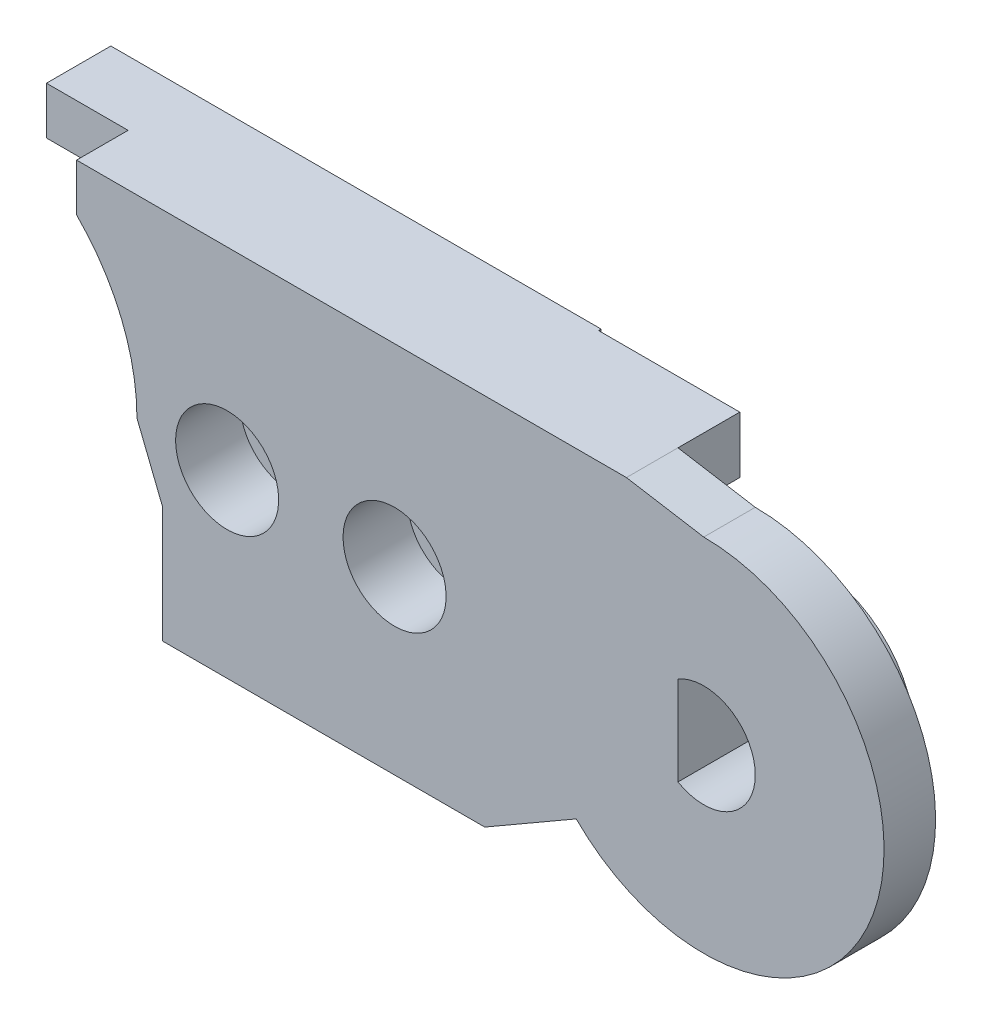
ISO-10303-21;
HEADER;
FILE_DESCRIPTION(('STEP AP214'),'2;1');
FILE_NAME('part.step','',(''),(''),'','','');
FILE_SCHEMA(('AUTOMOTIVE_DESIGN { 1 0 10303 214 1 1 1 1 }'));
ENDSEC;
DATA;
#1=APPLICATION_CONTEXT('core data for automotive mechanical design processes');
#2=APPLICATION_PROTOCOL_DEFINITION('international standard','automotive_design',2000,#1);
#3=PRODUCT_CONTEXT('',#1,'mechanical');
#4=PRODUCT('Part','Part','',(#3));
#5=PRODUCT_RELATED_PRODUCT_CATEGORY('part','',(#4));
#6=PRODUCT_DEFINITION_FORMATION('','',#4);
#7=PRODUCT_DEFINITION_CONTEXT('part definition',#1,'design');
#8=PRODUCT_DEFINITION('design','',#6,#7);
#9=PRODUCT_DEFINITION_SHAPE('','',#8);
#10=(LENGTH_UNIT() NAMED_UNIT(*) SI_UNIT(.MILLI.,.METRE.));
#11=(NAMED_UNIT(*) PLANE_ANGLE_UNIT() SI_UNIT($,.RADIAN.));
#12=(NAMED_UNIT(*) SI_UNIT($,.STERADIAN.) SOLID_ANGLE_UNIT());
#13=UNCERTAINTY_MEASURE_WITH_UNIT(LENGTH_MEASURE(1.E-05),#10,'distance_accuracy_value','');
#14=(GEOMETRIC_REPRESENTATION_CONTEXT(3) GLOBAL_UNCERTAINTY_ASSIGNED_CONTEXT((#13)) GLOBAL_UNIT_ASSIGNED_CONTEXT((#10,
#11,#12)) REPRESENTATION_CONTEXT('',''));
#15=CARTESIAN_POINT('',(0.,0.,0.));
#16=DIRECTION('',(0.,0.,1.));
#17=DIRECTION('',(1.,0.,0.));
#18=AXIS2_PLACEMENT_3D('',#15,#16,#17);
#19=CARTESIAN_POINT('',(0.,0.,11.5));
#20=DIRECTION('',(0.,0.,-1.));
#21=DIRECTION('',(1.,0.,0.));
#22=AXIS2_PLACEMENT_3D('',#19,#20,#21);
#23=PLANE('',#22);
#24=DIRECTION('',(0.,-1.,0.));
#25=VECTOR('',#24,1.);
#26=CARTESIAN_POINT('',(21.5203540034992,0.,11.5));
#27=LINE('',#26,#25);
#28=CARTESIAN_POINT('',(21.5203540034992,7.5,11.5));
#29=VERTEX_POINT('',#28);
#30=CARTESIAN_POINT('',(21.5203540034992,5.3,11.5));
#31=VERTEX_POINT('',#30);
#32=EDGE_CURVE('E298',#29,#31,#27,.T.);
#33=ORIENTED_EDGE('',*,*,#32,.T.);
#34=DIRECTION('',(-1.,0.,0.));
#35=VECTOR('',#34,1.);
#36=CARTESIAN_POINT('',(18.0980804477077,5.3,11.5));
#37=LINE('',#36,#35);
#38=CARTESIAN_POINT('',(5.99249530663145,5.3,11.5));
#39=VERTEX_POINT('',#38);
#40=EDGE_CURVE('E306',#31,#39,#37,.T.);
#41=ORIENTED_EDGE('',*,*,#40,.T.);
#42=CARTESIAN_POINT('',(0.,0.,11.5));
#43=DIRECTION('',(0.,0.,-1.));
#44=DIRECTION('',(1.,0.,0.));
#45=AXIS2_PLACEMENT_3D('',#42,#43,#44);
#46=CIRCLE('',#45,8.);
#47=CARTESIAN_POINT('',(5.65685424949238,5.65685424949238,11.5));
#48=VERTEX_POINT('',#47);
#49=EDGE_CURVE('E332',#48,#39,#46,.T.);
#50=ORIENTED_EDGE('',*,*,#49,.F.);
#51=DIRECTION('',(1.,0.,0.));
#52=VECTOR('',#51,1.);
#53=CARTESIAN_POINT('',(5.65685424949238,5.65685424949238,11.5));
#54=LINE('',#53,#52);
#55=CARTESIAN_POINT('',(2.48679014755027,5.65685424949238,11.5));
#56=VERTEX_POINT('',#55);
#57=EDGE_CURVE('E364',#56,#48,#54,.T.);
#58=ORIENTED_EDGE('',*,*,#57,.F.);
#59=DIRECTION('',(0.,-1.,0.));
#60=VECTOR('',#59,1.);
#61=CARTESIAN_POINT('',(2.48679014755027,7.5,11.5));
#62=LINE('',#61,#60);
#63=CARTESIAN_POINT('',(2.48679014755027,7.5,11.5));
#64=VERTEX_POINT('',#63);
#65=EDGE_CURVE('E360',#64,#56,#62,.T.);
#66=ORIENTED_EDGE('',*,*,#65,.F.);
#67=DIRECTION('',(-1.,0.,0.));
#68=VECTOR('',#67,1.);
#69=CARTESIAN_POINT('',(21.5,7.5,11.5));
#70=LINE('',#69,#68);
#71=EDGE_CURVE('E356',#29,#64,#70,.T.);
#72=ORIENTED_EDGE('',*,*,#71,.F.);
#73=EDGE_LOOP('',(#33,#41,#50,#58,#66,#72));
#74=FACE_BOUND('',#73,.T.);
#75=ADVANCED_FACE('F42',(#74),#23,.T.);
#76=CARTESIAN_POINT('',(30.,0.,11.7));
#77=DIRECTION('',(0.,0.,-1.));
#78=DIRECTION('',(1.,0.,0.));
#79=AXIS2_PLACEMENT_3D('',#76,#77,#78);
#80=PLANE('',#79);
#81=CARTESIAN_POINT('',(30.,0.,11.7));
#82=DIRECTION('',(0.,0.,1.));
#83=DIRECTION('',(1.,0.,0.));
#84=AXIS2_PLACEMENT_3D('',#81,#82,#83);
#85=CIRCLE('',#84,1.99999999999999);
#86=CARTESIAN_POINT('',(29.,-1.73205080756886,11.7));
#87=VERTEX_POINT('',#86);
#88=CARTESIAN_POINT('',(29.,1.73205080756886,11.7));
#89=VERTEX_POINT('',#88);
#90=EDGE_CURVE('E231',#87,#89,#85,.T.);
#91=ORIENTED_EDGE('',*,*,#90,.T.);
#92=DIRECTION('',(0.,-1.,0.));
#93=VECTOR('',#92,1.);
#94=CARTESIAN_POINT('',(29.,1.73205080756886,11.7));
#95=LINE('',#94,#93);
#96=EDGE_CURVE('E222',#89,#87,#95,.T.);
#97=ORIENTED_EDGE('',*,*,#96,.T.);
#98=EDGE_LOOP('',(#91,#97));
#99=FACE_BOUND('',#98,.T.);
#100=CARTESIAN_POINT('',(30.,0.,11.7));
#101=DIRECTION('',(0.,0.,1.));
#102=DIRECTION('',(1.,0.,0.));
#103=AXIS2_PLACEMENT_3D('',#100,#101,#102);
#104=CIRCLE('',#103,3.89999999999999);
#105=CARTESIAN_POINT('',(33.9,0.,11.7));
#106=VERTEX_POINT('',#105);
#107=EDGE_CURVE('E242',#106,#106,#104,.T.);
#108=ORIENTED_EDGE('',*,*,#107,.F.);
#109=EDGE_LOOP('',(#108));
#110=FACE_BOUND('',#109,.T.);
#111=ADVANCED_FACE('F551',(#99,#110),#80,.T.);
#112=CARTESIAN_POINT('',(30.,0.,16.));
#113=DIRECTION('',(0.,0.,-1.));
#114=DIRECTION('',(1.,0.,0.));
#115=AXIS2_PLACEMENT_3D('',#112,#113,#114);
#116=CYLINDRICAL_SURFACE('',#115,1.99999999999999);
#117=ORIENTED_EDGE('',*,*,#90,.F.);
#118=DIRECTION('',(0.,0.,-1.));
#119=VECTOR('',#118,1.);
#120=CARTESIAN_POINT('',(29.,-1.73205080756886,16.));
#121=LINE('',#120,#119);
#122=CARTESIAN_POINT('',(29.,-1.73205080756886,16.));
#123=VERTEX_POINT('',#122);
#124=EDGE_CURVE('E225',#123,#87,#121,.T.);
#125=ORIENTED_EDGE('',*,*,#124,.F.);
#126=CARTESIAN_POINT('',(30.,0.,16.));
#127=DIRECTION('',(0.,0.,1.));
#128=DIRECTION('',(1.,0.,0.));
#129=AXIS2_PLACEMENT_3D('',#126,#127,#128);
#130=CIRCLE('',#129,1.99999999999999);
#131=CARTESIAN_POINT('',(29.,1.73205080756886,16.));
#132=VERTEX_POINT('',#131);
#133=EDGE_CURVE('E216',#123,#132,#130,.T.);
#134=ORIENTED_EDGE('',*,*,#133,.T.);
#135=DIRECTION('',(0.,0.,-1.));
#136=VECTOR('',#135,1.);
#137=CARTESIAN_POINT('',(29.,1.73205080756886,16.));
#138=LINE('',#137,#136);
#139=EDGE_CURVE('E67',#132,#89,#138,.T.);
#140=ORIENTED_EDGE('',*,*,#139,.T.);
#141=EDGE_LOOP('',(#117,#125,#134,#140));
#142=FACE_BOUND('',#141,.T.);
#143=ADVANCED_FACE('F227',(#142),#116,.F.);
#144=CARTESIAN_POINT('',(29.,1.73205080756886,16.));
#145=DIRECTION('',(-1.,0.,0.));
#146=DIRECTION('',(0.,0.,-1.));
#147=AXIS2_PLACEMENT_3D('',#144,#145,#146);
#148=PLANE('',#147);
#149=ORIENTED_EDGE('',*,*,#96,.F.);
#150=ORIENTED_EDGE('',*,*,#139,.F.);
#151=DIRECTION('',(0.,-1.,0.));
#152=VECTOR('',#151,1.);
#153=CARTESIAN_POINT('',(29.,1.73205080756886,16.));
#154=LINE('',#153,#152);
#155=EDGE_CURVE('E60',#132,#123,#154,.T.);
#156=ORIENTED_EDGE('',*,*,#155,.T.);
#157=ORIENTED_EDGE('',*,*,#124,.T.);
#158=EDGE_LOOP('',(#149,#150,#156,#157));
#159=FACE_BOUND('',#158,.T.);
#160=ADVANCED_FACE('F220',(#159),#148,.F.);
#161=CARTESIAN_POINT('',(18.,0.,13.5));
#162=DIRECTION('',(0.,0.,1.));
#163=DIRECTION('',(-1.,0.,0.));
#164=AXIS2_PLACEMENT_3D('',#161,#162,#163);
#165=CYLINDRICAL_SURFACE('',#164,2.);
#166=CARTESIAN_POINT('',(18.,0.,13.5));
#167=DIRECTION('',(0.,0.,-1.));
#168=DIRECTION('',(-1.,0.,0.));
#169=AXIS2_PLACEMENT_3D('',#166,#167,#168);
#170=CIRCLE('',#169,2.);
#171=CARTESIAN_POINT('',(16.,0.,13.5));
#172=VERTEX_POINT('',#171);
#173=EDGE_CURVE('E517',#172,#172,#170,.T.);
#174=ORIENTED_EDGE('',*,*,#173,.T.);
#175=EDGE_LOOP('',(#174));
#176=FACE_BOUND('',#175,.T.);
#177=CARTESIAN_POINT('',(18.,0.,16.));
#178=DIRECTION('',(0.,0.,-1.));
#179=DIRECTION('',(-1.,0.,0.));
#180=AXIS2_PLACEMENT_3D('',#177,#178,#179);
#181=CIRCLE('',#180,2.);
#182=CARTESIAN_POINT('',(16.,0.,16.));
#183=VERTEX_POINT('',#182);
#184=EDGE_CURVE('E523',#183,#183,#181,.T.);
#185=ORIENTED_EDGE('',*,*,#184,.F.);
#186=EDGE_LOOP('',(#185));
#187=FACE_BOUND('',#186,.T.);
#188=ADVANCED_FACE('F800',(#176,#187),#165,.F.);
#189=CARTESIAN_POINT('',(11.5,0.,13.5));
#190=DIRECTION('',(0.,0.,1.));
#191=DIRECTION('',(-1.,0.,0.));
#192=AXIS2_PLACEMENT_3D('',#189,#190,#191);
#193=CYLINDRICAL_SURFACE('',#192,2.);
#194=CARTESIAN_POINT('',(11.5,0.,13.5));
#195=DIRECTION('',(0.,0.,-1.));
#196=DIRECTION('',(-1.,0.,0.));
#197=AXIS2_PLACEMENT_3D('',#194,#195,#196);
#198=CIRCLE('',#197,2.);
#199=CARTESIAN_POINT('',(9.5,0.,13.5));
#200=VERTEX_POINT('',#199);
#201=EDGE_CURVE('E503',#200,#200,#198,.T.);
#202=ORIENTED_EDGE('',*,*,#201,.T.);
#203=EDGE_LOOP('',(#202));
#204=FACE_BOUND('',#203,.T.);
#205=CARTESIAN_POINT('',(11.5,0.,16.));
#206=DIRECTION('',(0.,0.,-1.));
#207=DIRECTION('',(-1.,0.,0.));
#208=AXIS2_PLACEMENT_3D('',#205,#206,#207);
#209=CIRCLE('',#208,2.);
#210=CARTESIAN_POINT('',(9.5,0.,16.));
#211=VERTEX_POINT('',#210);
#212=EDGE_CURVE('E511',#211,#211,#209,.T.);
#213=ORIENTED_EDGE('',*,*,#212,.F.);
#214=EDGE_LOOP('',(#213));
#215=FACE_BOUND('',#214,.T.);
#216=ADVANCED_FACE('F804',(#204,#215),#193,.F.);
#217=CARTESIAN_POINT('',(30.,0.,11.7));
#218=DIRECTION('',(0.,0.,1.));
#219=DIRECTION('',(-1.,0.,0.));
#220=AXIS2_PLACEMENT_3D('',#217,#218,#219);
#221=CYLINDRICAL_SURFACE('',#220,3.89999999999999);
#222=ORIENTED_EDGE('',*,*,#107,.T.);
#223=EDGE_LOOP('',(#222));
#224=FACE_BOUND('',#223,.T.);
#225=CARTESIAN_POINT('',(30.,0.,14.));
#226=DIRECTION('',(0.,0.,1.));
#227=DIRECTION('',(1.,0.,0.));
#228=AXIS2_PLACEMENT_3D('',#225,#226,#227);
#229=CIRCLE('',#228,3.89999999999999);
#230=CARTESIAN_POINT('',(33.9,0.,14.));
#231=VERTEX_POINT('',#230);
#232=EDGE_CURVE('E240',#231,#231,#229,.T.);
#233=ORIENTED_EDGE('',*,*,#232,.F.);
#234=EDGE_LOOP('',(#233));
#235=FACE_BOUND('',#234,.T.);
#236=ADVANCED_FACE('F603',(#224,#235),#221,.T.);
#237=CARTESIAN_POINT('',(30.,0.,14.));
#238=DIRECTION('',(0.,0.,1.));
#239=DIRECTION('',(-1.,0.,0.));
#240=AXIS2_PLACEMENT_3D('',#237,#238,#239);
#241=CYLINDRICAL_SURFACE('',#240,7.);
#242=CARTESIAN_POINT('',(30.,0.,16.));
#243=DIRECTION('',(0.,0.,1.));
#244=DIRECTION('',(1.,0.,0.));
#245=AXIS2_PLACEMENT_3D('',#242,#243,#244);
#246=CIRCLE('',#245,7.);
#247=CARTESIAN_POINT('',(25.0502525316942,-4.94974746830584,16.));
#248=VERTEX_POINT('',#247);
#249=CARTESIAN_POINT('',(30.,7.00000000000001,16.));
#250=VERTEX_POINT('',#249);
#251=EDGE_CURVE('E417',#248,#250,#246,.T.);
#252=ORIENTED_EDGE('',*,*,#251,.F.);
#253=DIRECTION('',(0.,0.,1.));
#254=VECTOR('',#253,1.);
#255=CARTESIAN_POINT('',(25.0502525316942,-4.94974746830584,14.));
#256=LINE('',#255,#254);
#257=CARTESIAN_POINT('',(25.0502525316942,-4.94974746830584,14.));
#258=VERTEX_POINT('',#257);
#259=EDGE_CURVE('E460',#258,#248,#256,.T.);
#260=ORIENTED_EDGE('',*,*,#259,.F.);
#261=CARTESIAN_POINT('',(30.,0.,14.));
#262=DIRECTION('',(0.,0.,1.));
#263=DIRECTION('',(1.,0.,0.));
#264=AXIS2_PLACEMENT_3D('',#261,#262,#263);
#265=CIRCLE('',#264,7.);
#266=CARTESIAN_POINT('',(30.,7.00000000000001,14.));
#267=VERTEX_POINT('',#266);
#268=EDGE_CURVE('E425',#258,#267,#265,.T.);
#269=ORIENTED_EDGE('',*,*,#268,.T.);
#270=DIRECTION('',(0.,0.,1.));
#271=VECTOR('',#270,1.);
#272=CARTESIAN_POINT('',(30.,7.00000000000001,14.));
#273=LINE('',#272,#271);
#274=EDGE_CURVE('E465',#267,#250,#273,.T.);
#275=ORIENTED_EDGE('',*,*,#274,.T.);
#276=EDGE_LOOP('',(#252,#260,#269,#275));
#277=FACE_BOUND('',#276,.T.);
#278=ADVANCED_FACE('F599',(#277),#241,.T.);
#279=CARTESIAN_POINT('',(5.65685424949238,5.65685424949238,14.));
#280=DIRECTION('',(-1.,0.,0.));
#281=DIRECTION('',(0.,0.,-1.));
#282=AXIS2_PLACEMENT_3D('',#279,#280,#281);
#283=PLANE('',#282);
#284=DIRECTION('',(0.,1.,0.));
#285=VECTOR('',#284,1.);
#286=CARTESIAN_POINT('',(5.65685424949238,5.65685424949238,16.));
#287=LINE('',#286,#285);
#288=CARTESIAN_POINT('',(5.65685424949238,5.65685424949238,16.));
#289=VERTEX_POINT('',#288);
#290=CARTESIAN_POINT('',(5.65685424949238,7.5,16.));
#291=VERTEX_POINT('',#290);
#292=EDGE_CURVE('E446',#289,#291,#287,.T.);
#293=ORIENTED_EDGE('',*,*,#292,.T.);
#294=DIRECTION('',(0.,0.,1.));
#295=VECTOR('',#294,1.);
#296=CARTESIAN_POINT('',(5.65685424949238,7.5,14.));
#297=LINE('',#296,#295);
#298=CARTESIAN_POINT('',(5.65685424949238,7.5,14.));
#299=VERTEX_POINT('',#298);
#300=EDGE_CURVE('E473',#299,#291,#297,.T.);
#301=ORIENTED_EDGE('',*,*,#300,.F.);
#302=DIRECTION('',(0.,1.,0.));
#303=VECTOR('',#302,1.);
#304=CARTESIAN_POINT('',(5.65685424949238,5.65685424949238,14.));
#305=LINE('',#304,#303);
#306=CARTESIAN_POINT('',(5.65685424949238,5.65685424949238,14.));
#307=VERTEX_POINT('',#306);
#308=EDGE_CURVE('E416',#307,#299,#305,.T.);
#309=ORIENTED_EDGE('',*,*,#308,.F.);
#310=DIRECTION('',(0.,0.,1.));
#311=VECTOR('',#310,1.);
#312=CARTESIAN_POINT('',(5.65685424949238,5.65685424949238,14.));
#313=LINE('',#312,#311);
#314=EDGE_CURVE('E477',#307,#289,#313,.T.);
#315=ORIENTED_EDGE('',*,*,#314,.T.);
#316=EDGE_LOOP('',(#293,#301,#309,#315));
#317=FACE_BOUND('',#316,.T.);
#318=ADVANCED_FACE('F602',(#317),#283,.T.);
#319=CARTESIAN_POINT('',(30.,7.00000000000001,14.));
#320=DIRECTION('',(-0.164398987305353,-0.986393923832144,0.));
#321=DIRECTION('',(0.986393923832144,-0.164398987305353,0.));
#322=AXIS2_PLACEMENT_3D('',#319,#320,#321);
#323=PLANE('',#322);
#324=DIRECTION('',(-0.986393923832145,0.164398987305353,0.));
#325=VECTOR('',#324,1.);
#326=CARTESIAN_POINT('',(30.,7.00000000000001,16.));
#327=LINE('',#326,#325);
#328=CARTESIAN_POINT('',(27.,7.5,16.));
#329=VERTEX_POINT('',#328);
#330=EDGE_CURVE('E453',#250,#329,#327,.T.);
#331=ORIENTED_EDGE('',*,*,#330,.F.);
#332=ORIENTED_EDGE('',*,*,#274,.F.);
#333=DIRECTION('',(-0.986393923832145,0.164398987305353,0.));
#334=VECTOR('',#333,1.);
#335=CARTESIAN_POINT('',(30.,7.00000000000001,14.));
#336=LINE('',#335,#334);
#337=CARTESIAN_POINT('',(27.,7.5,14.));
#338=VERTEX_POINT('',#337);
#339=EDGE_CURVE('E421',#267,#338,#336,.T.);
#340=ORIENTED_EDGE('',*,*,#339,.T.);
#341=DIRECTION('',(0.,0.,1.));
#342=VECTOR('',#341,1.);
#343=CARTESIAN_POINT('',(27.,7.5,14.));
#344=LINE('',#343,#342);
#345=EDGE_CURVE('E469',#338,#329,#344,.T.);
#346=ORIENTED_EDGE('',*,*,#345,.T.);
#347=EDGE_LOOP('',(#331,#332,#340,#346));
#348=FACE_BOUND('',#347,.T.);
#349=ADVANCED_FACE('F605',(#348),#323,.F.);
#350=CARTESIAN_POINT('',(8.,0.,14.));
#351=DIRECTION('',(0.928476690885259,0.371390676354104,0.));
#352=DIRECTION('',(-0.371390676354104,0.928476690885259,0.));
#353=AXIS2_PLACEMENT_3D('',#350,#351,#352);
#354=PLANE('',#353);
#355=DIRECTION('',(0.371390676354104,-0.928476690885259,0.));
#356=VECTOR('',#355,1.);
#357=CARTESIAN_POINT('',(8.,0.,16.));
#358=LINE('',#357,#356);
#359=CARTESIAN_POINT('',(8.,0.,16.));
#360=VERTEX_POINT('',#359);
#361=CARTESIAN_POINT('',(9.,-2.5,16.));
#362=VERTEX_POINT('',#361);
#363=EDGE_CURVE('E439',#360,#362,#358,.T.);
#364=ORIENTED_EDGE('',*,*,#363,.F.);
#365=DIRECTION('',(0.,0.,1.));
#366=VECTOR('',#365,1.);
#367=CARTESIAN_POINT('',(8.,0.,14.));
#368=LINE('',#367,#366);
#369=CARTESIAN_POINT('',(8.,0.,11.5));
#370=VERTEX_POINT('',#369);
#371=EDGE_CURVE('E481',#370,#360,#368,.T.);
#372=ORIENTED_EDGE('',*,*,#371,.F.);
#373=DIRECTION('',(0.371390676354105,-0.928476690885259,0.));
#374=VECTOR('',#373,1.);
#375=CARTESIAN_POINT('',(8.,0.,11.5));
#376=LINE('',#375,#374);
#377=CARTESIAN_POINT('',(9.,-2.5,11.5));
#378=VERTEX_POINT('',#377);
#379=EDGE_CURVE('E336',#370,#378,#376,.T.);
#380=ORIENTED_EDGE('',*,*,#379,.T.);
#381=DIRECTION('',(0.,0.,1.));
#382=VECTOR('',#381,1.);
#383=CARTESIAN_POINT('',(9.,-2.5,14.));
#384=LINE('',#383,#382);
#385=EDGE_CURVE('E485',#378,#362,#384,.T.);
#386=ORIENTED_EDGE('',*,*,#385,.T.);
#387=EDGE_LOOP('',(#364,#372,#380,#386));
#388=FACE_BOUND('',#387,.T.);
#389=ADVANCED_FACE('F608',(#388),#354,.F.);
#390=CARTESIAN_POINT('',(9.,-6.99999999999999,14.));
#391=DIRECTION('',(-1.,0.,0.));
#392=DIRECTION('',(0.,0.,-1.));
#393=AXIS2_PLACEMENT_3D('',#390,#391,#392);
#394=PLANE('',#393);
#395=DIRECTION('',(0.,1.,0.));
#396=VECTOR('',#395,1.);
#397=CARTESIAN_POINT('',(9.,-6.99999999999999,16.));
#398=LINE('',#397,#396);
#399=CARTESIAN_POINT('',(9.,-6.99999999999999,16.));
#400=VERTEX_POINT('',#399);
#401=EDGE_CURVE('E436',#400,#362,#398,.T.);
#402=ORIENTED_EDGE('',*,*,#401,.T.);
#403=ORIENTED_EDGE('',*,*,#385,.F.);
#404=DIRECTION('',(0.,-1.,0.));
#405=VECTOR('',#404,1.);
#406=CARTESIAN_POINT('',(9.,-2.5,11.5));
#407=LINE('',#406,#405);
#408=CARTESIAN_POINT('',(9.,-6.99999999999999,11.5));
#409=VERTEX_POINT('',#408);
#410=EDGE_CURVE('E341',#378,#409,#407,.T.);
#411=ORIENTED_EDGE('',*,*,#410,.T.);
#412=DIRECTION('',(0.,0.,1.));
#413=VECTOR('',#412,1.);
#414=CARTESIAN_POINT('',(9.,-6.99999999999999,14.));
#415=LINE('',#414,#413);
#416=EDGE_CURVE('E489',#409,#400,#415,.T.);
#417=ORIENTED_EDGE('',*,*,#416,.T.);
#418=EDGE_LOOP('',(#402,#403,#411,#417));
#419=FACE_BOUND('',#418,.T.);
#420=ADVANCED_FACE('F623',(#419),#394,.T.);
#421=CARTESIAN_POINT('',(25.0502525316942,-4.94974746830585,14.));
#422=DIRECTION('',(0.500093895229062,-0.865971186561437,0.));
#423=DIRECTION('',(0.865971186561437,0.500093895229062,0.));
#424=AXIS2_PLACEMENT_3D('',#421,#422,#423);
#425=PLANE('',#424);
#426=DIRECTION('',(-0.865971186561437,-0.500093895229062,0.));
#427=VECTOR('',#426,1.);
#428=CARTESIAN_POINT('',(25.0502525316942,-4.94974746830585,16.));
#429=LINE('',#428,#427);
#430=CARTESIAN_POINT('',(21.5,-6.99999999999999,16.));
#431=VERTEX_POINT('',#430);
#432=EDGE_CURVE('E411',#248,#431,#429,.T.);
#433=ORIENTED_EDGE('',*,*,#432,.T.);
#434=DIRECTION('',(0.,0.,1.));
#435=VECTOR('',#434,1.);
#436=CARTESIAN_POINT('',(21.5,-6.99999999999999,14.));
#437=LINE('',#436,#435);
#438=CARTESIAN_POINT('',(21.5,-6.99999999999999,11.5));
#439=VERTEX_POINT('',#438);
#440=EDGE_CURVE('E429',#439,#431,#437,.T.);
#441=ORIENTED_EDGE('',*,*,#440,.F.);
#442=DIRECTION('',(0.865971186561437,0.500093895229063,0.));
#443=VECTOR('',#442,1.);
#444=CARTESIAN_POINT('',(21.5,-6.99999999999999,11.5));
#445=LINE('',#444,#443);
#446=CARTESIAN_POINT('',(23.2751262658471,-5.97487373415292,11.5));
#447=VERTEX_POINT('',#446);
#448=EDGE_CURVE('E348',#439,#447,#445,.T.);
#449=ORIENTED_EDGE('',*,*,#448,.T.);
#450=DIRECTION('',(0.,0.,1.));
#451=VECTOR('',#450,1.);
#452=CARTESIAN_POINT('',(23.2751262658471,-5.97487373415292,11.5));
#453=LINE('',#452,#451);
#454=CARTESIAN_POINT('',(23.2751262658471,-5.97487373415292,14.));
#455=VERTEX_POINT('',#454);
#456=EDGE_CURVE('E407',#447,#455,#453,.T.);
#457=ORIENTED_EDGE('',*,*,#456,.T.);
#458=DIRECTION('',(-0.865971186561437,-0.500093895229062,0.));
#459=VECTOR('',#458,1.);
#460=CARTESIAN_POINT('',(25.0502525316942,-4.94974746830585,14.));
#461=LINE('',#460,#459);
#462=EDGE_CURVE('E412',#258,#455,#461,.T.);
#463=ORIENTED_EDGE('',*,*,#462,.F.);
#464=ORIENTED_EDGE('',*,*,#259,.T.);
#465=EDGE_LOOP('',(#433,#441,#449,#457,#463,#464));
#466=FACE_BOUND('',#465,.T.);
#467=ADVANCED_FACE('F44',(#466),#425,.T.);
#468=CARTESIAN_POINT('',(27.,2.1720062451962,11.5));
#469=DIRECTION('',(0.,1.,0.));
#470=DIRECTION('',(0.,0.,-1.));
#471=AXIS2_PLACEMENT_3D('',#468,#469,#470);
#472=PLANE('',#471);
#473=DIRECTION('',(1.,0.,0.));
#474=VECTOR('',#473,1.);
#475=CARTESIAN_POINT('',(27.,2.1720062451962,14.));
#476=LINE('',#475,#474);
#477=CARTESIAN_POINT('',(23.2751262658471,2.1720062451962,14.));
#478=VERTEX_POINT('',#477);
#479=CARTESIAN_POINT('',(23.3,2.1720062451962,14.));
#480=VERTEX_POINT('',#479);
#481=EDGE_CURVE('E371',#478,#480,#476,.T.);
#482=ORIENTED_EDGE('',*,*,#481,.F.);
#483=DIRECTION('',(0.,0.,1.));
#484=VECTOR('',#483,1.);
#485=CARTESIAN_POINT('',(23.2751262658471,2.1720062451962,11.5));
#486=LINE('',#485,#484);
#487=CARTESIAN_POINT('',(23.2751262658471,2.1720062451962,11.6));
#488=VERTEX_POINT('',#487);
#489=EDGE_CURVE('E403',#488,#478,#486,.T.);
#490=ORIENTED_EDGE('',*,*,#489,.F.);
#491=DIRECTION('',(1.,0.,0.));
#492=VECTOR('',#491,1.);
#493=CARTESIAN_POINT('',(27.,2.1720062451962,11.6));
#494=LINE('',#493,#492);
#495=CARTESIAN_POINT('',(23.3,2.1720062451962,11.6));
#496=VERTEX_POINT('',#495);
#497=EDGE_CURVE('E260',#488,#496,#494,.T.);
#498=ORIENTED_EDGE('',*,*,#497,.T.);
#499=DIRECTION('',(0.,0.,-1.));
#500=VECTOR('',#499,1.);
#501=CARTESIAN_POINT('',(23.3,2.1720062451962,14.));
#502=LINE('',#501,#500);
#503=EDGE_CURVE('E256',#480,#496,#502,.T.);
#504=ORIENTED_EDGE('',*,*,#503,.F.);
#505=EDGE_LOOP('',(#482,#490,#498,#504));
#506=FACE_BOUND('',#505,.T.);
#507=ADVANCED_FACE('F575',(#506),#472,.F.);
#508=CARTESIAN_POINT('',(2.48679014755027,7.5,11.5));
#509=DIRECTION('',(1.,0.,0.));
#510=DIRECTION('',(0.,0.,1.));
#511=AXIS2_PLACEMENT_3D('',#508,#509,#510);
#512=PLANE('',#511);
#513=DIRECTION('',(0.,-1.,0.));
#514=VECTOR('',#513,1.);
#515=CARTESIAN_POINT('',(2.48679014755027,7.5,14.));
#516=LINE('',#515,#514);
#517=CARTESIAN_POINT('',(2.48679014755027,7.5,14.));
#518=VERTEX_POINT('',#517);
#519=CARTESIAN_POINT('',(2.48679014755027,5.65685424949238,14.));
#520=VERTEX_POINT('',#519);
#521=EDGE_CURVE('E381',#518,#520,#516,.T.);
#522=ORIENTED_EDGE('',*,*,#521,.F.);
#523=DIRECTION('',(0.,0.,1.));
#524=VECTOR('',#523,1.);
#525=CARTESIAN_POINT('',(2.48679014755027,7.5,11.5));
#526=LINE('',#525,#524);
#527=EDGE_CURVE('E395',#64,#518,#526,.T.);
#528=ORIENTED_EDGE('',*,*,#527,.F.);
#529=ORIENTED_EDGE('',*,*,#65,.T.);
#530=DIRECTION('',(0.,0.,1.));
#531=VECTOR('',#530,1.);
#532=CARTESIAN_POINT('',(2.48679014755027,5.65685424949238,11.5));
#533=LINE('',#532,#531);
#534=EDGE_CURVE('E391',#56,#520,#533,.T.);
#535=ORIENTED_EDGE('',*,*,#534,.T.);
#536=EDGE_LOOP('',(#522,#528,#529,#535));
#537=FACE_BOUND('',#536,.T.);
#538=ADVANCED_FACE('F571',(#537),#512,.F.);
#539=CARTESIAN_POINT('',(27.,7.5,11.5));
#540=DIRECTION('',(-1.,0.,0.));
#541=DIRECTION('',(0.,0.,-1.));
#542=AXIS2_PLACEMENT_3D('',#539,#540,#541);
#543=PLANE('',#542);
#544=DIRECTION('',(0.,0.,1.));
#545=VECTOR('',#544,1.);
#546=CARTESIAN_POINT('',(27.,7.5,11.5));
#547=LINE('',#546,#545);
#548=CARTESIAN_POINT('',(27.,7.5,11.6));
#549=VERTEX_POINT('',#548);
#550=EDGE_CURVE('E399',#549,#338,#547,.T.);
#551=ORIENTED_EDGE('',*,*,#550,.T.);
#552=DIRECTION('',(0.,1.,0.));
#553=VECTOR('',#552,1.);
#554=CARTESIAN_POINT('',(27.,7.5,14.));
#555=LINE('',#554,#553);
#556=CARTESIAN_POINT('',(27.,5.3,14.));
#557=VERTEX_POINT('',#556);
#558=EDGE_CURVE('E375',#557,#338,#555,.T.);
#559=ORIENTED_EDGE('',*,*,#558,.F.);
#560=DIRECTION('',(0.,0.,1.));
#561=VECTOR('',#560,1.);
#562=CARTESIAN_POINT('',(27.,5.3,11.5));
#563=LINE('',#562,#561);
#564=CARTESIAN_POINT('',(27.,5.3,11.6));
#565=VERTEX_POINT('',#564);
#566=EDGE_CURVE('E310',#565,#557,#563,.T.);
#567=ORIENTED_EDGE('',*,*,#566,.F.);
#568=DIRECTION('',(0.,1.,0.));
#569=VECTOR('',#568,1.);
#570=CARTESIAN_POINT('',(27.,2.1720062451962,11.6));
#571=LINE('',#570,#569);
#572=EDGE_CURVE('E268',#565,#549,#571,.T.);
#573=ORIENTED_EDGE('',*,*,#572,.T.);
#574=EDGE_LOOP('',(#551,#559,#567,#573));
#575=FACE_BOUND('',#574,.T.);
#576=ADVANCED_FACE('F574',(#575),#543,.F.);
#577=CARTESIAN_POINT('',(0.,0.,14.));
#578=DIRECTION('',(0.,0.,1.));
#579=DIRECTION('',(-1.,0.,0.));
#580=AXIS2_PLACEMENT_3D('',#577,#578,#579);
#581=CYLINDRICAL_SURFACE('',#580,8.);
#582=CARTESIAN_POINT('',(0.,0.,14.));
#583=DIRECTION('',(0.,0.,-1.));
#584=DIRECTION('',(-1.,0.,0.));
#585=AXIS2_PLACEMENT_3D('',#582,#583,#584);
#586=CIRCLE('',#585,8.);
#587=CARTESIAN_POINT('',(5.99249530663146,5.3,14.));
#588=VERTEX_POINT('',#587);
#589=CARTESIAN_POINT('',(6.92820323027551,4.,14.));
#590=VERTEX_POINT('',#589);
#591=EDGE_CURVE('E327',#588,#590,#586,.T.);
#592=ORIENTED_EDGE('',*,*,#591,.T.);
#593=DIRECTION('',(0.,0.,1.));
#594=VECTOR('',#593,1.);
#595=CARTESIAN_POINT('',(6.92820323027551,4.,14.));
#596=LINE('',#595,#594);
#597=CARTESIAN_POINT('',(6.92820323027551,4.,11.5));
#598=VERTEX_POINT('',#597);
#599=EDGE_CURVE('E320',#598,#590,#596,.T.);
#600=ORIENTED_EDGE('',*,*,#599,.F.);
#601=EDGE_CURVE('E337',#598,#370,#46,.T.);
#602=ORIENTED_EDGE('',*,*,#601,.T.);
#603=ORIENTED_EDGE('',*,*,#371,.T.);
#604=CARTESIAN_POINT('',(0.,0.,16.));
#605=DIRECTION('',(0.,0.,1.));
#606=DIRECTION('',(1.,0.,0.));
#607=AXIS2_PLACEMENT_3D('',#604,#605,#606);
#608=CIRCLE('',#607,8.);
#609=EDGE_CURVE('E443',#360,#289,#608,.T.);
#610=ORIENTED_EDGE('',*,*,#609,.T.);
#611=ORIENTED_EDGE('',*,*,#314,.F.);
#612=DIRECTION('',(0.,0.,1.));
#613=VECTOR('',#612,1.);
#614=CARTESIAN_POINT('',(5.65685424949238,5.65685424949238,11.5));
#615=LINE('',#614,#613);
#616=EDGE_CURVE('E368',#48,#307,#615,.T.);
#617=ORIENTED_EDGE('',*,*,#616,.F.);
#618=ORIENTED_EDGE('',*,*,#49,.T.);
#619=DIRECTION('',(0.,0.,1.));
#620=VECTOR('',#619,1.);
#621=CARTESIAN_POINT('',(5.99249530663146,5.3,14.));
#622=LINE('',#621,#620);
#623=EDGE_CURVE('E324',#588,#39,#622,.F.);
#624=ORIENTED_EDGE('',*,*,#623,.F.);
#625=EDGE_LOOP('',(#592,#600,#602,#603,#610,#611,#617,#618,#624));
#626=FACE_BOUND('',#625,.T.);
#627=ADVANCED_FACE('F579',(#626),#581,.F.);
#628=CARTESIAN_POINT('',(0.,0.,14.));
#629=DIRECTION('',(0.,0.,-1.));
#630=DIRECTION('',(1.,0.,0.));
#631=AXIS2_PLACEMENT_3D('',#628,#629,#630);
#632=PLANE('',#631);
#633=ORIENTED_EDGE('',*,*,#232,.T.);
#634=EDGE_LOOP('',(#633));
#635=FACE_BOUND('',#634,.T.);
#636=DIRECTION('',(0.,-1.,0.));
#637=VECTOR('',#636,1.);
#638=CARTESIAN_POINT('',(23.3,2.1720062451962,14.));
#639=LINE('',#638,#637);
#640=CARTESIAN_POINT('',(23.3,4.,14.));
#641=VERTEX_POINT('',#640);
#642=EDGE_CURVE('E250',#641,#480,#639,.T.);
#643=ORIENTED_EDGE('',*,*,#642,.F.);
#644=DIRECTION('',(1.,0.,0.));
#645=VECTOR('',#644,1.);
#646=CARTESIAN_POINT('',(27.,4.,14.));
#647=LINE('',#646,#645);
#648=EDGE_CURVE('E311',#590,#641,#647,.T.);
#649=ORIENTED_EDGE('',*,*,#648,.F.);
#650=ORIENTED_EDGE('',*,*,#591,.F.);
#651=DIRECTION('',(-1.,0.,0.));
#652=VECTOR('',#651,1.);
#653=CARTESIAN_POINT('',(18.0980804477077,5.3,14.));
#654=LINE('',#653,#652);
#655=EDGE_CURVE('E305',#557,#588,#654,.T.);
#656=ORIENTED_EDGE('',*,*,#655,.F.);
#657=ORIENTED_EDGE('',*,*,#558,.T.);
#658=ORIENTED_EDGE('',*,*,#339,.F.);
#659=ORIENTED_EDGE('',*,*,#268,.F.);
#660=ORIENTED_EDGE('',*,*,#462,.T.);
#661=DIRECTION('',(0.,1.,0.));
#662=VECTOR('',#661,1.);
#663=CARTESIAN_POINT('',(23.2751262658471,-5.97487373415292,14.));
#664=LINE('',#663,#662);
#665=EDGE_CURVE('E331',#455,#478,#664,.T.);
#666=ORIENTED_EDGE('',*,*,#665,.T.);
#667=ORIENTED_EDGE('',*,*,#481,.T.);
#668=EDGE_LOOP('',(#643,#649,#650,#656,#657,#658,#659,#660,#666,#667));
#669=FACE_BOUND('',#668,.T.);
#670=ADVANCED_FACE('F590',(#635,#669),#632,.T.);
#671=CARTESIAN_POINT('',(23.3,2.1720062451962,14.));
#672=DIRECTION('',(-1.,0.,0.));
#673=DIRECTION('',(0.,0.,-1.));
#674=AXIS2_PLACEMENT_3D('',#671,#672,#673);
#675=PLANE('',#674);
#676=DIRECTION('',(0.,-1.,0.));
#677=VECTOR('',#676,1.);
#678=CARTESIAN_POINT('',(23.3,2.1720062451962,11.6));
#679=LINE('',#678,#677);
#680=CARTESIAN_POINT('',(23.3,4.,11.6));
#681=VERTEX_POINT('',#680);
#682=EDGE_CURVE('E246',#681,#496,#679,.T.);
#683=ORIENTED_EDGE('',*,*,#682,.F.);
#684=DIRECTION('',(0.,0.,-1.));
#685=VECTOR('',#684,1.);
#686=CARTESIAN_POINT('',(23.3,4.,14.));
#687=LINE('',#686,#685);
#688=EDGE_CURVE('E253',#641,#681,#687,.T.);
#689=ORIENTED_EDGE('',*,*,#688,.F.);
#690=ORIENTED_EDGE('',*,*,#642,.T.);
#691=ORIENTED_EDGE('',*,*,#503,.T.);
#692=EDGE_LOOP('',(#683,#689,#690,#691));
#693=FACE_BOUND('',#692,.T.);
#694=ADVANCED_FACE('F593',(#693),#675,.F.);
#695=CARTESIAN_POINT('',(27.,4.,11.5));
#696=DIRECTION('',(0.,1.,0.));
#697=DIRECTION('',(0.,0.,-1.));
#698=AXIS2_PLACEMENT_3D('',#695,#696,#697);
#699=PLANE('',#698);
#700=ORIENTED_EDGE('',*,*,#688,.T.);
#701=DIRECTION('',(-1.,0.,0.));
#702=VECTOR('',#701,1.);
#703=CARTESIAN_POINT('',(27.,4.,11.6));
#704=LINE('',#703,#702);
#705=CARTESIAN_POINT('',(21.5203540034992,4.,11.6));
#706=VERTEX_POINT('',#705);
#707=EDGE_CURVE('E52',#681,#706,#704,.T.);
#708=ORIENTED_EDGE('',*,*,#707,.T.);
#709=DIRECTION('',(0.,0.,-1.));
#710=VECTOR('',#709,1.);
#711=CARTESIAN_POINT('',(21.5203540034992,4.,11.5));
#712=LINE('',#711,#710);
#713=CARTESIAN_POINT('',(21.5203540034992,4.,11.5));
#714=VERTEX_POINT('',#713);
#715=EDGE_CURVE('E12',#706,#714,#712,.T.);
#716=ORIENTED_EDGE('',*,*,#715,.T.);
#717=DIRECTION('',(-1.,0.,0.));
#718=VECTOR('',#717,1.);
#719=CARTESIAN_POINT('',(0.,4.,11.5));
#720=LINE('',#719,#718);
#721=EDGE_CURVE('E464',#714,#598,#720,.T.);
#722=ORIENTED_EDGE('',*,*,#721,.T.);
#723=ORIENTED_EDGE('',*,*,#599,.T.);
#724=ORIENTED_EDGE('',*,*,#648,.T.);
#725=EDGE_LOOP('',(#700,#708,#716,#722,#723,#724));
#726=FACE_BOUND('',#725,.T.);
#727=ADVANCED_FACE('F683',(#726),#699,.T.);
#728=CARTESIAN_POINT('',(21.5203540034992,2.1720062451962,11.6));
#729=DIRECTION('',(-1.,0.,0.));
#730=DIRECTION('',(0.,0.,-1.));
#731=AXIS2_PLACEMENT_3D('',#728,#729,#730);
#732=PLANE('',#731);
#733=DIRECTION('',(0.,-1.,0.));
#734=VECTOR('',#733,1.);
#735=CARTESIAN_POINT('',(21.5203540034992,0.,11.5));
#736=LINE('',#735,#734);
#737=CARTESIAN_POINT('',(21.5203540034992,2.1720062451962,11.5));
#738=VERTEX_POINT('',#737);
#739=EDGE_CURVE('E291',#714,#738,#736,.T.);
#740=ORIENTED_EDGE('',*,*,#739,.F.);
#741=ORIENTED_EDGE('',*,*,#715,.F.);
#742=DIRECTION('',(0.,-1.,0.));
#743=VECTOR('',#742,1.);
#744=CARTESIAN_POINT('',(21.5203540034992,2.1720062451962,11.6));
#745=LINE('',#744,#743);
#746=CARTESIAN_POINT('',(21.5203540034992,2.1720062451962,11.6));
#747=VERTEX_POINT('',#746);
#748=EDGE_CURVE('E276',#706,#747,#745,.T.);
#749=ORIENTED_EDGE('',*,*,#748,.T.);
#750=DIRECTION('',(0.,0.,-1.));
#751=VECTOR('',#750,1.);
#752=CARTESIAN_POINT('',(21.5203540034992,2.1720062451962,11.6));
#753=LINE('',#752,#751);
#754=EDGE_CURVE('E282',#747,#738,#753,.T.);
#755=ORIENTED_EDGE('',*,*,#754,.T.);
#756=EDGE_LOOP('',(#740,#741,#749,#755));
#757=FACE_BOUND('',#756,.T.);
#758=ADVANCED_FACE('F681',(#757),#732,.F.);
#759=CARTESIAN_POINT('',(0.,0.,11.6));
#760=DIRECTION('',(0.,0.,1.));
#761=DIRECTION('',(-1.,0.,0.));
#762=AXIS2_PLACEMENT_3D('',#759,#760,#761);
#763=PLANE('',#762);
#764=ORIENTED_EDGE('',*,*,#497,.F.);
#765=EDGE_CURVE('E264',#747,#488,#494,.T.);
#766=ORIENTED_EDGE('',*,*,#765,.F.);
#767=ORIENTED_EDGE('',*,*,#748,.F.);
#768=ORIENTED_EDGE('',*,*,#707,.F.);
#769=ORIENTED_EDGE('',*,*,#682,.T.);
#770=EDGE_LOOP('',(#764,#766,#767,#768,#769));
#771=FACE_BOUND('',#770,.T.);
#772=ADVANCED_FACE('F588',(#771),#763,.F.);
#773=CARTESIAN_POINT('',(23.2751262658471,-5.97487373415292,11.5));
#774=DIRECTION('',(-1.,0.,0.));
#775=DIRECTION('',(0.,0.,-1.));
#776=AXIS2_PLACEMENT_3D('',#773,#774,#775);
#777=PLANE('',#776);
#778=ORIENTED_EDGE('',*,*,#665,.F.);
#779=ORIENTED_EDGE('',*,*,#456,.F.);
#780=DIRECTION('',(0.,1.,0.));
#781=VECTOR('',#780,1.);
#782=CARTESIAN_POINT('',(23.2751262658471,-5.97487373415292,11.5));
#783=LINE('',#782,#781);
#784=CARTESIAN_POINT('',(23.2751262658471,2.1720062451962,11.5));
#785=VERTEX_POINT('',#784);
#786=EDGE_CURVE('E352',#447,#785,#783,.T.);
#787=ORIENTED_EDGE('',*,*,#786,.T.);
#788=EDGE_CURVE('E404',#785,#488,#486,.T.);
#789=ORIENTED_EDGE('',*,*,#788,.T.);
#790=ORIENTED_EDGE('',*,*,#489,.T.);
#791=EDGE_LOOP('',(#778,#779,#787,#789,#790));
#792=FACE_BOUND('',#791,.T.);
#793=ADVANCED_FACE('F584',(#792),#777,.F.);
#794=CARTESIAN_POINT('',(27.,2.1720062451962,11.6));
#795=DIRECTION('',(0.,-1.,0.));
#796=DIRECTION('',(0.,0.,1.));
#797=AXIS2_PLACEMENT_3D('',#794,#795,#796);
#798=PLANE('',#797);
#799=DIRECTION('',(1.,0.,0.));
#800=VECTOR('',#799,1.);
#801=CARTESIAN_POINT('',(0.,2.1720062451962,11.5));
#802=LINE('',#801,#800);
#803=EDGE_CURVE('E302',#738,#785,#802,.T.);
#804=ORIENTED_EDGE('',*,*,#803,.F.);
#805=ORIENTED_EDGE('',*,*,#754,.F.);
#806=ORIENTED_EDGE('',*,*,#765,.T.);
#807=ORIENTED_EDGE('',*,*,#788,.F.);
#808=EDGE_LOOP('',(#804,#805,#806,#807));
#809=FACE_BOUND('',#808,.T.);
#810=ADVANCED_FACE('F587',(#809),#798,.F.);
#811=CARTESIAN_POINT('',(5.65685424949238,7.5,14.));
#812=DIRECTION('',(0.,1.,0.));
#813=DIRECTION('',(-1.,0.,0.));
#814=AXIS2_PLACEMENT_3D('',#811,#812,#813);
#815=PLANE('',#814);
#816=DIRECTION('',(0.,0.,-1.));
#817=VECTOR('',#816,1.);
#818=CARTESIAN_POINT('',(21.5203540034992,7.5,11.6));
#819=LINE('',#818,#817);
#820=CARTESIAN_POINT('',(21.5203540034992,7.5,11.6));
#821=VERTEX_POINT('',#820);
#822=EDGE_CURVE('E281',#821,#29,#819,.T.);
#823=ORIENTED_EDGE('',*,*,#822,.T.);
#824=ORIENTED_EDGE('',*,*,#71,.T.);
#825=ORIENTED_EDGE('',*,*,#527,.T.);
#826=DIRECTION('',(-1.,0.,0.));
#827=VECTOR('',#826,1.);
#828=CARTESIAN_POINT('',(5.65685424949238,7.5,14.));
#829=LINE('',#828,#827);
#830=EDGE_CURVE('E378',#299,#518,#829,.T.);
#831=ORIENTED_EDGE('',*,*,#830,.F.);
#832=ORIENTED_EDGE('',*,*,#300,.T.);
#833=DIRECTION('',(1.,0.,0.));
#834=VECTOR('',#833,1.);
#835=CARTESIAN_POINT('',(5.65685424949238,7.5,16.));
#836=LINE('',#835,#834);
#837=EDGE_CURVE('E450',#291,#329,#836,.T.);
#838=ORIENTED_EDGE('',*,*,#837,.T.);
#839=ORIENTED_EDGE('',*,*,#345,.F.);
#840=ORIENTED_EDGE('',*,*,#550,.F.);
#841=DIRECTION('',(-1.,0.,0.));
#842=VECTOR('',#841,1.);
#843=CARTESIAN_POINT('',(27.,7.5,11.6));
#844=LINE('',#843,#842);
#845=EDGE_CURVE('E272',#549,#821,#844,.T.);
#846=ORIENTED_EDGE('',*,*,#845,.T.);
#847=EDGE_LOOP('',(#823,#824,#825,#831,#832,#838,#839,#840,#846));
#848=FACE_BOUND('',#847,.T.);
#849=ADVANCED_FACE('F610',(#848),#815,.T.);
#850=DIRECTION('',(1.,0.,0.));
#851=VECTOR('',#850,1.);
#852=CARTESIAN_POINT('',(18.0980804477077,5.3,11.6));
#853=LINE('',#852,#851);
#854=CARTESIAN_POINT('',(21.5203540034992,5.3,11.6));
#855=VERTEX_POINT('',#854);
#856=EDGE_CURVE('E286',#855,#565,#853,.T.);
#857=ORIENTED_EDGE('',*,*,#856,.F.);
#858=EDGE_CURVE('E277',#821,#855,#745,.T.);
#859=ORIENTED_EDGE('',*,*,#858,.F.);
#860=ORIENTED_EDGE('',*,*,#845,.F.);
#861=ORIENTED_EDGE('',*,*,#572,.F.);
#862=EDGE_LOOP('',(#857,#859,#860,#861));
#863=FACE_BOUND('',#862,.T.);
#864=ADVANCED_FACE('F613',(#863),#763,.F.);
#865=CARTESIAN_POINT('',(18.0980804477077,5.3,11.5));
#866=DIRECTION('',(0.,-1.,0.));
#867=DIRECTION('',(0.,0.,1.));
#868=AXIS2_PLACEMENT_3D('',#865,#866,#867);
#869=PLANE('',#868);
#870=DIRECTION('',(0.,0.,1.));
#871=VECTOR('',#870,1.);
#872=CARTESIAN_POINT('',(21.5203540034992,5.3,11.5));
#873=LINE('',#872,#871);
#874=EDGE_CURVE('E295',#31,#855,#873,.T.);
#875=ORIENTED_EDGE('',*,*,#874,.T.);
#876=ORIENTED_EDGE('',*,*,#856,.T.);
#877=ORIENTED_EDGE('',*,*,#566,.T.);
#878=ORIENTED_EDGE('',*,*,#655,.T.);
#879=ORIENTED_EDGE('',*,*,#623,.T.);
#880=ORIENTED_EDGE('',*,*,#40,.F.);
#881=EDGE_LOOP('',(#875,#876,#877,#878,#879,#880));
#882=FACE_BOUND('',#881,.T.);
#883=ADVANCED_FACE('F560',(#882),#869,.T.);
#884=ORIENTED_EDGE('',*,*,#32,.F.);
#885=ORIENTED_EDGE('',*,*,#822,.F.);
#886=ORIENTED_EDGE('',*,*,#858,.T.);
#887=ORIENTED_EDGE('',*,*,#874,.F.);
#888=EDGE_LOOP('',(#884,#885,#886,#887));
#889=FACE_BOUND('',#888,.T.);
#890=ADVANCED_FACE('F566',(#889),#732,.F.);
#891=CARTESIAN_POINT('',(0.,0.,14.));
#892=DIRECTION('',(0.,0.,-1.));
#893=DIRECTION('',(1.,0.,0.));
#894=AXIS2_PLACEMENT_3D('',#891,#892,#893);
#895=PLANE('',#894);
#896=ORIENTED_EDGE('',*,*,#308,.T.);
#897=ORIENTED_EDGE('',*,*,#830,.T.);
#898=ORIENTED_EDGE('',*,*,#521,.T.);
#899=DIRECTION('',(1.,0.,0.));
#900=VECTOR('',#899,1.);
#901=CARTESIAN_POINT('',(5.65685424949238,5.65685424949238,14.));
#902=LINE('',#901,#900);
#903=EDGE_CURVE('E385',#520,#307,#902,.T.);
#904=ORIENTED_EDGE('',*,*,#903,.T.);
#905=EDGE_LOOP('',(#896,#897,#898,#904));
#906=FACE_BOUND('',#905,.T.);
#907=ADVANCED_FACE('F562',(#906),#895,.F.);
#908=CARTESIAN_POINT('',(5.65685424949238,5.65685424949238,11.5));
#909=DIRECTION('',(0.,1.,0.));
#910=DIRECTION('',(0.,0.,-1.));
#911=AXIS2_PLACEMENT_3D('',#908,#909,#910);
#912=PLANE('',#911);
#913=ORIENTED_EDGE('',*,*,#903,.F.);
#914=ORIENTED_EDGE('',*,*,#534,.F.);
#915=ORIENTED_EDGE('',*,*,#57,.T.);
#916=ORIENTED_EDGE('',*,*,#616,.T.);
#917=EDGE_LOOP('',(#913,#914,#915,#916));
#918=FACE_BOUND('',#917,.T.);
#919=ADVANCED_FACE('F565',(#918),#912,.F.);
#920=CARTESIAN_POINT('',(0.,0.,16.));
#921=DIRECTION('',(0.,0.,-1.));
#922=DIRECTION('',(1.,0.,0.));
#923=AXIS2_PLACEMENT_3D('',#920,#921,#922);
#924=PLANE('',#923);
#925=ORIENTED_EDGE('',*,*,#212,.T.);
#926=EDGE_LOOP('',(#925));
#927=FACE_BOUND('',#926,.T.);
#928=ORIENTED_EDGE('',*,*,#184,.T.);
#929=EDGE_LOOP('',(#928));
#930=FACE_BOUND('',#929,.T.);
#931=ORIENTED_EDGE('',*,*,#155,.F.);
#932=ORIENTED_EDGE('',*,*,#133,.F.);
#933=EDGE_LOOP('',(#931,#932));
#934=FACE_BOUND('',#933,.T.);
#935=ORIENTED_EDGE('',*,*,#432,.F.);
#936=ORIENTED_EDGE('',*,*,#251,.T.);
#937=ORIENTED_EDGE('',*,*,#330,.T.);
#938=ORIENTED_EDGE('',*,*,#837,.F.);
#939=ORIENTED_EDGE('',*,*,#292,.F.);
#940=ORIENTED_EDGE('',*,*,#609,.F.);
#941=ORIENTED_EDGE('',*,*,#363,.T.);
#942=ORIENTED_EDGE('',*,*,#401,.F.);
#943=DIRECTION('',(-1.,0.,0.));
#944=VECTOR('',#943,1.);
#945=CARTESIAN_POINT('',(21.5,-6.99999999999999,16.));
#946=LINE('',#945,#944);
#947=EDGE_CURVE('E433',#431,#400,#946,.T.);
#948=ORIENTED_EDGE('',*,*,#947,.F.);
#949=EDGE_LOOP('',(#935,#936,#937,#938,#939,#940,#941,#942,#948));
#950=FACE_BOUND('',#949,.T.);
#951=ADVANCED_FACE('F214',(#927,#930,#934,#950),#924,.F.);
#952=CARTESIAN_POINT('',(21.5,-6.99999999999999,14.));
#953=DIRECTION('',(0.,-1.,0.));
#954=DIRECTION('',(1.,0.,0.));
#955=AXIS2_PLACEMENT_3D('',#952,#953,#954);
#956=PLANE('',#955);
#957=ORIENTED_EDGE('',*,*,#947,.T.);
#958=ORIENTED_EDGE('',*,*,#416,.F.);
#959=DIRECTION('',(1.,0.,0.));
#960=VECTOR('',#959,1.);
#961=CARTESIAN_POINT('',(9.,-6.99999999999999,11.5));
#962=LINE('',#961,#960);
#963=EDGE_CURVE('E345',#409,#439,#962,.T.);
#964=ORIENTED_EDGE('',*,*,#963,.T.);
#965=ORIENTED_EDGE('',*,*,#440,.T.);
#966=EDGE_LOOP('',(#957,#958,#964,#965));
#967=FACE_BOUND('',#966,.T.);
#968=ADVANCED_FACE('F597',(#967),#956,.T.);
#969=CARTESIAN_POINT('',(18.,0.,13.5));
#970=DIRECTION('',(0.,0.,1.));
#971=DIRECTION('',(-1.,0.,0.));
#972=AXIS2_PLACEMENT_3D('',#969,#970,#971);
#973=PLANE('',#972);
#974=ORIENTED_EDGE('',*,*,#173,.F.);
#975=EDGE_LOOP('',(#974));
#976=FACE_BOUND('',#975,.T.);
#977=CARTESIAN_POINT('',(18.,0.,13.5));
#978=DIRECTION('',(0.,0.,-1.));
#979=DIRECTION('',(-1.,0.,0.));
#980=AXIS2_PLACEMENT_3D('',#977,#978,#979);
#981=CIRCLE('',#980,0.950000000000001);
#982=CARTESIAN_POINT('',(17.05,0.,13.5));
#983=VERTEX_POINT('',#982);
#984=EDGE_CURVE('E46',#983,#983,#981,.F.);
#985=ORIENTED_EDGE('',*,*,#984,.F.);
#986=EDGE_LOOP('',(#985));
#987=FACE_BOUND('',#986,.T.);
#988=ADVANCED_FACE('F628',(#976,#987),#973,.T.);
#989=CARTESIAN_POINT('',(18.,0.,16.));
#990=DIRECTION('',(0.,0.,-1.));
#991=DIRECTION('',(1.,0.,0.));
#992=AXIS2_PLACEMENT_3D('',#989,#990,#991);
#993=CYLINDRICAL_SURFACE('',#992,0.950000000000001);
#994=CARTESIAN_POINT('',(18.,0.,11.5));
#995=DIRECTION('',(0.,0.,1.));
#996=DIRECTION('',(1.,0.,0.));
#997=AXIS2_PLACEMENT_3D('',#994,#995,#996);
#998=CIRCLE('',#997,0.950000000000001);
#999=CARTESIAN_POINT('',(18.95,0.,11.5));
#1000=VERTEX_POINT('',#999);
#1001=EDGE_CURVE('E509',#1000,#1000,#998,.T.);
#1002=ORIENTED_EDGE('',*,*,#1001,.F.);
#1003=EDGE_LOOP('',(#1002));
#1004=FACE_BOUND('',#1003,.T.);
#1005=ORIENTED_EDGE('',*,*,#984,.T.);
#1006=EDGE_LOOP('',(#1005));
#1007=FACE_BOUND('',#1006,.T.);
#1008=ADVANCED_FACE('F545',(#1004,#1007),#993,.F.);
#1009=CARTESIAN_POINT('',(11.5,0.,13.5));
#1010=DIRECTION('',(0.,0.,1.));
#1011=DIRECTION('',(-1.,0.,0.));
#1012=AXIS2_PLACEMENT_3D('',#1009,#1010,#1011);
#1013=PLANE('',#1012);
#1014=ORIENTED_EDGE('',*,*,#201,.F.);
#1015=EDGE_LOOP('',(#1014));
#1016=FACE_BOUND('',#1015,.T.);
#1017=CARTESIAN_POINT('',(11.5,0.,13.5));
#1018=DIRECTION('',(0.,0.,-1.));
#1019=DIRECTION('',(-1.,0.,0.));
#1020=AXIS2_PLACEMENT_3D('',#1017,#1018,#1019);
#1021=CIRCLE('',#1020,0.949999999999999);
#1022=CARTESIAN_POINT('',(10.55,0.,13.5));
#1023=VERTEX_POINT('',#1022);
#1024=EDGE_CURVE('E500',#1023,#1023,#1021,.F.);
#1025=ORIENTED_EDGE('',*,*,#1024,.F.);
#1026=EDGE_LOOP('',(#1025));
#1027=FACE_BOUND('',#1026,.T.);
#1028=ADVANCED_FACE('F538',(#1016,#1027),#1013,.T.);
#1029=CARTESIAN_POINT('',(11.5,0.,16.));
#1030=DIRECTION('',(0.,0.,-1.));
#1031=DIRECTION('',(1.,0.,0.));
#1032=AXIS2_PLACEMENT_3D('',#1029,#1030,#1031);
#1033=CYLINDRICAL_SURFACE('',#1032,0.949999999999999);
#1034=CARTESIAN_POINT('',(11.5,0.,11.5));
#1035=DIRECTION('',(0.,0.,1.));
#1036=DIRECTION('',(1.,0.,0.));
#1037=AXIS2_PLACEMENT_3D('',#1034,#1035,#1036);
#1038=CIRCLE('',#1037,0.949999999999999);
#1039=CARTESIAN_POINT('',(12.45,0.,11.5));
#1040=VERTEX_POINT('',#1039);
#1041=EDGE_CURVE('E234',#1040,#1040,#1038,.T.);
#1042=ORIENTED_EDGE('',*,*,#1041,.F.);
#1043=EDGE_LOOP('',(#1042));
#1044=FACE_BOUND('',#1043,.T.);
#1045=ORIENTED_EDGE('',*,*,#1024,.T.);
#1046=EDGE_LOOP('',(#1045));
#1047=FACE_BOUND('',#1046,.T.);
#1048=ADVANCED_FACE('F536',(#1044,#1047),#1033,.F.);
#1049=ORIENTED_EDGE('',*,*,#1041,.T.);
#1050=EDGE_LOOP('',(#1049));
#1051=FACE_BOUND('',#1050,.T.);
#1052=ORIENTED_EDGE('',*,*,#1001,.T.);
#1053=EDGE_LOOP('',(#1052));
#1054=FACE_BOUND('',#1053,.T.);
#1055=ORIENTED_EDGE('',*,*,#803,.T.);
#1056=ORIENTED_EDGE('',*,*,#786,.F.);
#1057=ORIENTED_EDGE('',*,*,#448,.F.);
#1058=ORIENTED_EDGE('',*,*,#963,.F.);
#1059=ORIENTED_EDGE('',*,*,#410,.F.);
#1060=ORIENTED_EDGE('',*,*,#379,.F.);
#1061=ORIENTED_EDGE('',*,*,#601,.F.);
#1062=ORIENTED_EDGE('',*,*,#721,.F.);
#1063=ORIENTED_EDGE('',*,*,#739,.T.);
#1064=EDGE_LOOP('',(#1055,#1056,#1057,#1058,#1059,#1060,#1061,#1062,#1063));
#1065=FACE_BOUND('',#1064,.T.);
#1066=ADVANCED_FACE('F534',(#1051,#1054,#1065),#23,.T.);
#1067=CLOSED_SHELL('',(#75,#111,#143,#160,#188,#216,#236,#278,#318,#349,#389,#420,#467,#507,
#538,#576,#627,#670,#694,#727,#758,#772,#793,#810,#849,#864,#883,#890,#907,#919,#951,#968,#988,
#1008,#1028,#1048,#1066));
#1068=MANIFOLD_SOLID_BREP('B2',#1067);
#1069=ADVANCED_BREP_SHAPE_REPRESENTATION('',(#18,#1068),#14);
#1070=SHAPE_DEFINITION_REPRESENTATION(#9,#1069);
ENDSEC;
END-ISO-10303-21;
